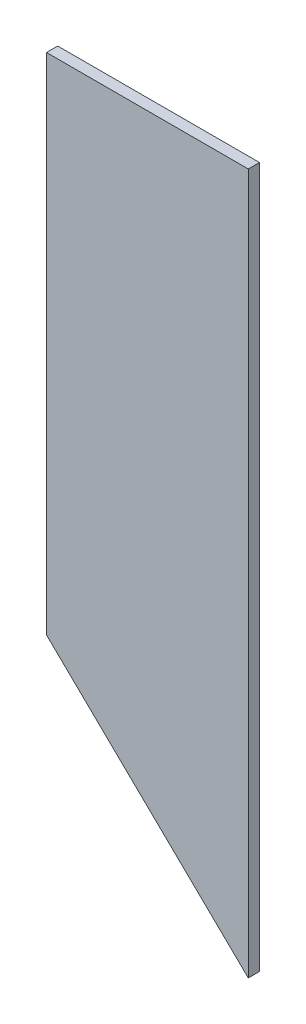
ISO-10303-21;
HEADER;
FILE_DESCRIPTION(('STEP AP214'),'2;1');
FILE_NAME('part.step','',(''),(''),'','','');
FILE_SCHEMA(('AUTOMOTIVE_DESIGN { 1 0 10303 214 1 1 1 1 }'));
ENDSEC;
DATA;
#1=APPLICATION_CONTEXT('core data for automotive mechanical design processes');
#2=APPLICATION_PROTOCOL_DEFINITION('international standard','automotive_design',2000,#1);
#3=PRODUCT_CONTEXT('',#1,'mechanical');
#4=PRODUCT('Part','Part','',(#3));
#5=PRODUCT_RELATED_PRODUCT_CATEGORY('part','',(#4));
#6=PRODUCT_DEFINITION_FORMATION('','',#4);
#7=PRODUCT_DEFINITION_CONTEXT('part definition',#1,'design');
#8=PRODUCT_DEFINITION('design','',#6,#7);
#9=PRODUCT_DEFINITION_SHAPE('','',#8);
#10=(LENGTH_UNIT() NAMED_UNIT(*) SI_UNIT(.MILLI.,.METRE.));
#11=(NAMED_UNIT(*) PLANE_ANGLE_UNIT() SI_UNIT($,.RADIAN.));
#12=(NAMED_UNIT(*) SI_UNIT($,.STERADIAN.) SOLID_ANGLE_UNIT());
#13=UNCERTAINTY_MEASURE_WITH_UNIT(LENGTH_MEASURE(1.E-05),#10,'distance_accuracy_value','');
#14=(GEOMETRIC_REPRESENTATION_CONTEXT(3) GLOBAL_UNCERTAINTY_ASSIGNED_CONTEXT((#13)) GLOBAL_UNIT_ASSIGNED_CONTEXT((#10,
#11,#12)) REPRESENTATION_CONTEXT('',''));
#15=CARTESIAN_POINT('',(0.,0.,0.));
#16=DIRECTION('',(0.,0.,1.));
#17=DIRECTION('',(1.,0.,0.));
#18=AXIS2_PLACEMENT_3D('',#15,#16,#17);
#19=CARTESIAN_POINT('',(-2.,259.,37.0000000000001));
#20=DIRECTION('',(-1.,0.,0.));
#21=DIRECTION('',(0.,-1.,0.));
#22=AXIS2_PLACEMENT_3D('',#19,#20,#21);
#23=PLANE('',#22);
#24=DIRECTION('',(0.,1.,0.));
#25=VECTOR('',#24,1.);
#26=CARTESIAN_POINT('',(-2.,259.,35.));
#27=LINE('',#26,#25);
#28=CARTESIAN_POINT('',(-1.99999999999999,134.,35.));
#29=VERTEX_POINT('',#28);
#30=CARTESIAN_POINT('',(-2.,259.,35.));
#31=VERTEX_POINT('',#30);
#32=EDGE_CURVE('E99',#29,#31,#27,.T.);
#33=ORIENTED_EDGE('',*,*,#32,.T.);
#34=DIRECTION('',(0.,0.,-1.));
#35=VECTOR('',#34,1.);
#36=CARTESIAN_POINT('',(-2.,259.,37.0000000000001));
#37=LINE('',#36,#35);
#38=CARTESIAN_POINT('',(-2.,259.,37.0000000000001));
#39=VERTEX_POINT('',#38);
#40=EDGE_CURVE('E11',#39,#31,#37,.T.);
#41=ORIENTED_EDGE('',*,*,#40,.F.);
#42=DIRECTION('',(0.,1.,0.));
#43=VECTOR('',#42,1.);
#44=CARTESIAN_POINT('',(-2.,259.,37.0000000000001));
#45=LINE('',#44,#43);
#46=CARTESIAN_POINT('',(-1.99999999999999,134.,37.0000000000001));
#47=VERTEX_POINT('',#46);
#48=EDGE_CURVE('E87',#47,#39,#45,.T.);
#49=ORIENTED_EDGE('',*,*,#48,.F.);
#50=DIRECTION('',(0.,0.,-1.));
#51=VECTOR('',#50,1.);
#52=CARTESIAN_POINT('',(-1.99999999999999,134.,37.0000000000001));
#53=LINE('',#52,#51);
#54=EDGE_CURVE('E95',#47,#29,#53,.T.);
#55=ORIENTED_EDGE('',*,*,#54,.T.);
#56=EDGE_LOOP('',(#33,#41,#49,#55));
#57=FACE_BOUND('',#56,.T.);
#58=ADVANCED_FACE('F36',(#57),#23,.F.);
#59=CARTESIAN_POINT('',(-38.,259.,37.0000000000001));
#60=DIRECTION('',(0.,-1.,0.));
#61=DIRECTION('',(0.,0.,-1.));
#62=AXIS2_PLACEMENT_3D('',#59,#60,#61);
#63=PLANE('',#62);
#64=DIRECTION('',(-1.,0.,0.));
#65=VECTOR('',#64,1.);
#66=CARTESIAN_POINT('',(-38.,259.,35.));
#67=LINE('',#66,#65);
#68=CARTESIAN_POINT('',(-38.,259.,35.));
#69=VERTEX_POINT('',#68);
#70=EDGE_CURVE('E91',#31,#69,#67,.T.);
#71=ORIENTED_EDGE('',*,*,#70,.T.);
#72=DIRECTION('',(0.,0.,-1.));
#73=VECTOR('',#72,1.);
#74=CARTESIAN_POINT('',(-38.,259.,37.0000000000001));
#75=LINE('',#74,#73);
#76=CARTESIAN_POINT('',(-38.,259.,37.0000000000001));
#77=VERTEX_POINT('',#76);
#78=EDGE_CURVE('E44',#77,#69,#75,.T.);
#79=ORIENTED_EDGE('',*,*,#78,.F.);
#80=DIRECTION('',(-1.,0.,0.));
#81=VECTOR('',#80,1.);
#82=CARTESIAN_POINT('',(-38.,259.,37.0000000000001));
#83=LINE('',#82,#81);
#84=EDGE_CURVE('E82',#39,#77,#83,.T.);
#85=ORIENTED_EDGE('',*,*,#84,.F.);
#86=ORIENTED_EDGE('',*,*,#40,.T.);
#87=EDGE_LOOP('',(#71,#79,#85,#86));
#88=FACE_BOUND('',#87,.T.);
#89=ADVANCED_FACE('F90',(#88),#63,.F.);
#90=CARTESIAN_POINT('',(-38.,169.,37.0000000000001));
#91=DIRECTION('',(1.,0.,0.));
#92=DIRECTION('',(0.,0.,-1.));
#93=AXIS2_PLACEMENT_3D('',#90,#91,#92);
#94=PLANE('',#93);
#95=DIRECTION('',(0.,-1.,0.));
#96=VECTOR('',#95,1.);
#97=CARTESIAN_POINT('',(-38.,169.,35.));
#98=LINE('',#97,#96);
#99=CARTESIAN_POINT('',(-38.,169.,35.));
#100=VERTEX_POINT('',#99);
#101=EDGE_CURVE('E69',#69,#100,#98,.T.);
#102=ORIENTED_EDGE('',*,*,#101,.T.);
#103=DIRECTION('',(0.,0.,-1.));
#104=VECTOR('',#103,1.);
#105=CARTESIAN_POINT('',(-38.,169.,37.0000000000001));
#106=LINE('',#105,#104);
#107=CARTESIAN_POINT('',(-38.,169.,37.0000000000001));
#108=VERTEX_POINT('',#107);
#109=EDGE_CURVE('E92',#108,#100,#106,.T.);
#110=ORIENTED_EDGE('',*,*,#109,.F.);
#111=DIRECTION('',(0.,-1.,0.));
#112=VECTOR('',#111,1.);
#113=CARTESIAN_POINT('',(-38.,169.,37.0000000000001));
#114=LINE('',#113,#112);
#115=EDGE_CURVE('E85',#77,#108,#114,.T.);
#116=ORIENTED_EDGE('',*,*,#115,.F.);
#117=ORIENTED_EDGE('',*,*,#78,.T.);
#118=EDGE_LOOP('',(#102,#110,#116,#117));
#119=FACE_BOUND('',#118,.T.);
#120=ADVANCED_FACE('F93',(#119),#94,.F.);
#121=CARTESIAN_POINT('',(-1.99999999999999,134.,37.0000000000001));
#122=DIRECTION('',(0.697078393291808,0.716994918814431,0.));
#123=DIRECTION('',(-0.716994918814431,0.697078393291808,0.));
#124=AXIS2_PLACEMENT_3D('',#121,#122,#123);
#125=PLANE('',#124);
#126=DIRECTION('',(0.716994918814431,-0.697078393291808,0.));
#127=VECTOR('',#126,1.);
#128=CARTESIAN_POINT('',(-1.99999999999999,134.,35.));
#129=LINE('',#128,#127);
#130=EDGE_CURVE('E75',#100,#29,#129,.T.);
#131=ORIENTED_EDGE('',*,*,#130,.T.);
#132=ORIENTED_EDGE('',*,*,#54,.F.);
#133=DIRECTION('',(0.716994918814431,-0.697078393291808,0.));
#134=VECTOR('',#133,1.);
#135=CARTESIAN_POINT('',(-1.99999999999999,134.,37.0000000000001));
#136=LINE('',#135,#134);
#137=EDGE_CURVE('E52',#108,#47,#136,.T.);
#138=ORIENTED_EDGE('',*,*,#137,.F.);
#139=ORIENTED_EDGE('',*,*,#109,.T.);
#140=EDGE_LOOP('',(#131,#132,#138,#139));
#141=FACE_BOUND('',#140,.T.);
#142=ADVANCED_FACE('F106',(#141),#125,.F.);
#143=CARTESIAN_POINT('',(0.,0.,37.0000000000001));
#144=DIRECTION('',(0.,0.,1.));
#145=DIRECTION('',(1.,0.,0.));
#146=AXIS2_PLACEMENT_3D('',#143,#144,#145);
#147=PLANE('',#146);
#148=ORIENTED_EDGE('',*,*,#48,.T.);
#149=ORIENTED_EDGE('',*,*,#84,.T.);
#150=ORIENTED_EDGE('',*,*,#115,.T.);
#151=ORIENTED_EDGE('',*,*,#137,.T.);
#152=EDGE_LOOP('',(#148,#149,#150,#151));
#153=FACE_BOUND('',#152,.T.);
#154=ADVANCED_FACE('F83',(#153),#147,.T.);
#155=CARTESIAN_POINT('',(0.,0.,35.));
#156=DIRECTION('',(0.,0.,1.));
#157=DIRECTION('',(1.,0.,0.));
#158=AXIS2_PLACEMENT_3D('',#155,#156,#157);
#159=PLANE('',#158);
#160=ORIENTED_EDGE('',*,*,#32,.F.);
#161=ORIENTED_EDGE('',*,*,#130,.F.);
#162=ORIENTED_EDGE('',*,*,#101,.F.);
#163=ORIENTED_EDGE('',*,*,#70,.F.);
#164=EDGE_LOOP('',(#160,#161,#162,#163));
#165=FACE_BOUND('',#164,.T.);
#166=ADVANCED_FACE('F109',(#165),#159,.F.);
#167=CLOSED_SHELL('',(#58,#89,#120,#142,#154,#166));
#168=MANIFOLD_SOLID_BREP('B2',#167);
#169=ADVANCED_BREP_SHAPE_REPRESENTATION('',(#18,#168),#14);
#170=SHAPE_DEFINITION_REPRESENTATION(#9,#169);
ENDSEC;
END-ISO-10303-21;
